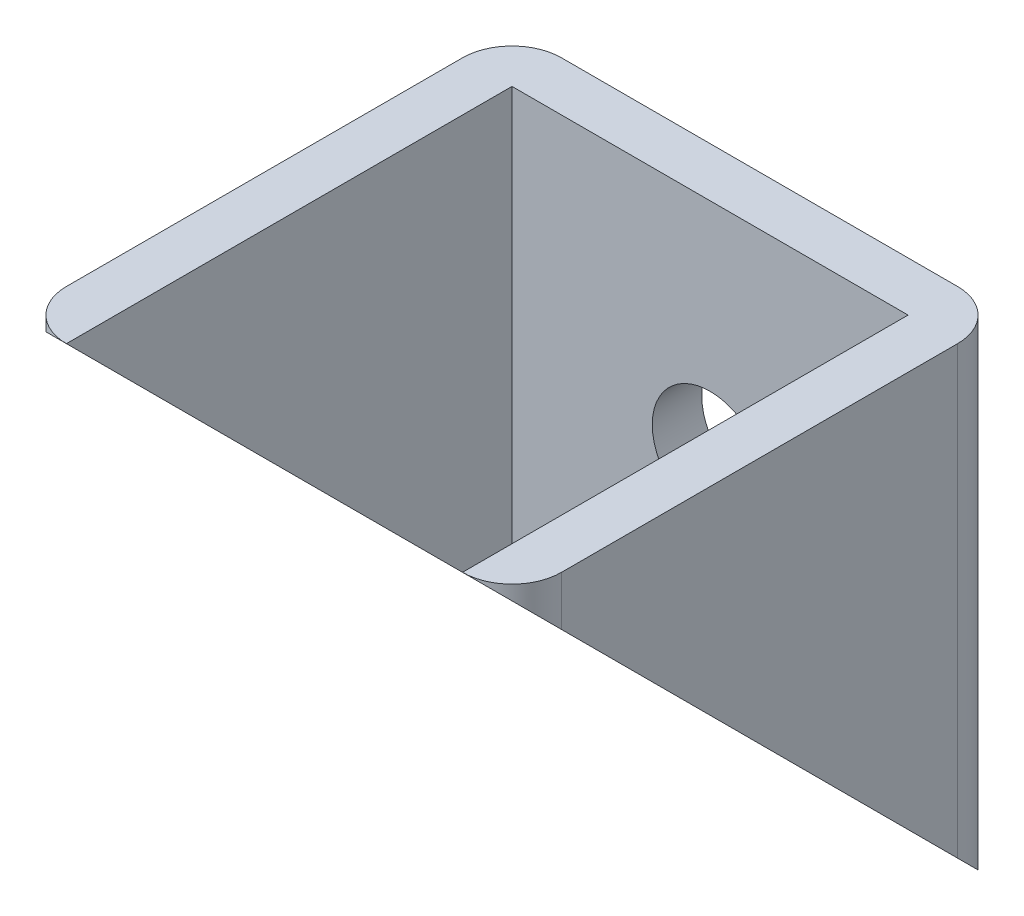
ISO-10303-21;
HEADER;
FILE_DESCRIPTION(('STEP AP214'),'2;1');
FILE_NAME('part.step','',(''),(''),'','','');
FILE_SCHEMA(('AUTOMOTIVE_DESIGN { 1 0 10303 214 1 1 1 1 }'));
ENDSEC;
DATA;
#1=APPLICATION_CONTEXT('core data for automotive mechanical design processes');
#2=APPLICATION_PROTOCOL_DEFINITION('international standard','automotive_design',2000,#1);
#3=PRODUCT_CONTEXT('',#1,'mechanical');
#4=PRODUCT('Part','Part','',(#3));
#5=PRODUCT_RELATED_PRODUCT_CATEGORY('part','',(#4));
#6=PRODUCT_DEFINITION_FORMATION('','',#4);
#7=PRODUCT_DEFINITION_CONTEXT('part definition',#1,'design');
#8=PRODUCT_DEFINITION('design','',#6,#7);
#9=PRODUCT_DEFINITION_SHAPE('','',#8);
#10=(LENGTH_UNIT() NAMED_UNIT(*) SI_UNIT(.MILLI.,.METRE.));
#11=(NAMED_UNIT(*) PLANE_ANGLE_UNIT() SI_UNIT($,.RADIAN.));
#12=(NAMED_UNIT(*) SI_UNIT($,.STERADIAN.) SOLID_ANGLE_UNIT());
#13=UNCERTAINTY_MEASURE_WITH_UNIT(LENGTH_MEASURE(1.E-05),#10,'distance_accuracy_value','');
#14=(GEOMETRIC_REPRESENTATION_CONTEXT(3) GLOBAL_UNCERTAINTY_ASSIGNED_CONTEXT((#13)) GLOBAL_UNIT_ASSIGNED_CONTEXT((#10,
#11,#12)) REPRESENTATION_CONTEXT('',''));
#15=CARTESIAN_POINT('',(0.,0.,0.));
#16=DIRECTION('',(0.,0.,1.));
#17=DIRECTION('',(1.,0.,0.));
#18=AXIS2_PLACEMENT_3D('',#15,#16,#17);
#19=CARTESIAN_POINT('',(12.,387.934536743125,-53.1201374153035));
#20=DIRECTION('',(0.,-1.,0.));
#21=DIRECTION('',(0.,0.,-1.));
#22=AXIS2_PLACEMENT_3D('',#19,#20,#21);
#23=CYLINDRICAL_SURFACE('',#22,3.);
#24=DIRECTION('',(0.,1.,0.));
#25=VECTOR('',#24,1.);
#26=CARTESIAN_POINT('',(15.,387.934536743125,-53.1201374153035));
#27=LINE('',#26,#25);
#28=CARTESIAN_POINT('',(15.,387.934536743125,-53.1201374153035));
#29=VERTEX_POINT('',#28);
#30=CARTESIAN_POINT('',(15.,384.934536743125,-53.1201374153035));
#31=VERTEX_POINT('',#30);
#32=EDGE_CURVE('E173',#29,#31,#27,.F.);
#33=ORIENTED_EDGE('',*,*,#32,.F.);
#34=CARTESIAN_POINT('',(12.,387.934536743125,-53.1201374153035));
#35=DIRECTION('',(0.,-1.,0.));
#36=DIRECTION('',(0.,0.,-1.));
#37=AXIS2_PLACEMENT_3D('',#34,#35,#36);
#38=CIRCLE('',#37,3.);
#39=CARTESIAN_POINT('',(12.,387.934536743125,-50.1201374153035));
#40=VERTEX_POINT('',#39);
#41=EDGE_CURVE('E149',#29,#40,#38,.T.);
#42=ORIENTED_EDGE('',*,*,#41,.T.);
#43=CARTESIAN_POINT('',(12.,384.934536743125,-53.1201374153035));
#44=DIRECTION('',(0.,0.707106781186547,-0.707106781186548));
#45=DIRECTION('',(0.,-0.707106781186548,-0.707106781186547));
#46=AXIS2_PLACEMENT_3D('',#43,#44,#45);
#47=ELLIPSE('',#46,4.24264068711929,3.);
#48=EDGE_CURVE('E141',#40,#31,#47,.T.);
#49=ORIENTED_EDGE('',*,*,#48,.T.);
#50=EDGE_LOOP('',(#33,#42,#49));
#51=FACE_BOUND('',#50,.T.);
#52=ADVANCED_FACE('F17',(#51),#23,.T.);
#53=CARTESIAN_POINT('',(15.,387.934536743125,-77.1201374153035));
#54=DIRECTION('',(1.,0.,0.));
#55=DIRECTION('',(0.,0.,-1.));
#56=AXIS2_PLACEMENT_3D('',#53,#54,#55);
#57=PLANE('',#56);
#58=DIRECTION('',(0.,0.,-1.));
#59=VECTOR('',#58,1.);
#60=CARTESIAN_POINT('',(15.,387.934536743125,-65.1201374153035));
#61=LINE('',#60,#59);
#62=CARTESIAN_POINT('',(15.,387.934536743125,-77.1201374153035));
#63=VERTEX_POINT('',#62);
#64=EDGE_CURVE('E152',#63,#29,#61,.F.);
#65=ORIENTED_EDGE('',*,*,#64,.T.);
#66=ORIENTED_EDGE('',*,*,#32,.T.);
#67=DIRECTION('',(0.,0.707106781186548,0.707106781186547));
#68=VECTOR('',#67,1.);
#69=CARTESIAN_POINT('',(15.,387.934536743125,-50.1201374153035));
#70=LINE('',#69,#68);
#71=CARTESIAN_POINT('',(15.,360.934536743125,-77.1201374153035));
#72=VERTEX_POINT('',#71);
#73=EDGE_CURVE('E139',#31,#72,#70,.F.);
#74=ORIENTED_EDGE('',*,*,#73,.T.);
#75=DIRECTION('',(0.,-1.,0.));
#76=VECTOR('',#75,1.);
#77=CARTESIAN_POINT('',(15.,387.934536743125,-77.1201374153035));
#78=LINE('',#77,#76);
#79=EDGE_CURVE('E143',#63,#72,#78,.T.);
#80=ORIENTED_EDGE('',*,*,#79,.F.);
#81=EDGE_LOOP('',(#65,#66,#74,#80));
#82=FACE_BOUND('',#81,.T.);
#83=ADVANCED_FACE('F212',(#82),#57,.T.);
#84=CARTESIAN_POINT('',(-12.,387.934536743125,-53.1201374153035));
#85=DIRECTION('',(0.,-1.,0.));
#86=DIRECTION('',(0.,0.,-1.));
#87=AXIS2_PLACEMENT_3D('',#84,#85,#86);
#88=CYLINDRICAL_SURFACE('',#87,3.);
#89=CARTESIAN_POINT('',(-12.,387.934536743125,-53.1201374153035));
#90=DIRECTION('',(0.,-1.,0.));
#91=DIRECTION('',(0.,0.,-1.));
#92=AXIS2_PLACEMENT_3D('',#89,#90,#91);
#93=CIRCLE('',#92,3.);
#94=CARTESIAN_POINT('',(-12.,387.934536743125,-50.1201374153035));
#95=VERTEX_POINT('',#94);
#96=CARTESIAN_POINT('',(-15.,387.934536743125,-53.1201374153035));
#97=VERTEX_POINT('',#96);
#98=EDGE_CURVE('E20',#95,#97,#93,.T.);
#99=ORIENTED_EDGE('',*,*,#98,.T.);
#100=DIRECTION('',(0.,1.,0.));
#101=VECTOR('',#100,1.);
#102=CARTESIAN_POINT('',(-15.,387.934536743125,-53.1201374153035));
#103=LINE('',#102,#101);
#104=CARTESIAN_POINT('',(-15.,384.934536743125,-53.1201374153035));
#105=VERTEX_POINT('',#104);
#106=EDGE_CURVE('E166',#105,#97,#103,.T.);
#107=ORIENTED_EDGE('',*,*,#106,.F.);
#108=CARTESIAN_POINT('',(-12.,384.934536743125,-53.1201374153035));
#109=DIRECTION('',(0.,0.707106781186547,-0.707106781186548));
#110=DIRECTION('',(0.,-0.707106781186548,-0.707106781186547));
#111=AXIS2_PLACEMENT_3D('',#108,#109,#110);
#112=ELLIPSE('',#111,4.24264068711929,3.);
#113=EDGE_CURVE('E132',#105,#95,#112,.T.);
#114=ORIENTED_EDGE('',*,*,#113,.T.);
#115=EDGE_LOOP('',(#99,#107,#114));
#116=FACE_BOUND('',#115,.T.);
#117=ADVANCED_FACE('F203',(#116),#88,.T.);
#118=CARTESIAN_POINT('',(-12.,387.934536743125,-77.1201374153035));
#119=DIRECTION('',(1.,0.,0.));
#120=DIRECTION('',(0.,0.,-1.));
#121=AXIS2_PLACEMENT_3D('',#118,#119,#120);
#122=PLANE('',#121);
#123=DIRECTION('',(0.,0.707106781186548,0.707106781186547));
#124=VECTOR('',#123,1.);
#125=CARTESIAN_POINT('',(-12.,387.934536743125,-50.1201374153035));
#126=LINE('',#125,#124);
#127=CARTESIAN_POINT('',(-12.,360.934536743125,-77.1201374153035));
#128=VERTEX_POINT('',#127);
#129=EDGE_CURVE('E130',#95,#128,#126,.F.);
#130=ORIENTED_EDGE('',*,*,#129,.T.);
#131=DIRECTION('',(0.,1.,0.));
#132=VECTOR('',#131,1.);
#133=CARTESIAN_POINT('',(-12.,387.934536743125,-77.1201374153035));
#134=LINE('',#133,#132);
#135=CARTESIAN_POINT('',(-12.,387.934536743125,-77.1201374153035));
#136=VERTEX_POINT('',#135);
#137=EDGE_CURVE('E81',#136,#128,#134,.F.);
#138=ORIENTED_EDGE('',*,*,#137,.F.);
#139=DIRECTION('',(0.,0.,-1.));
#140=VECTOR('',#139,1.);
#141=CARTESIAN_POINT('',(-12.,387.934536743125,-65.1201374153035));
#142=LINE('',#141,#140);
#143=EDGE_CURVE('E75',#136,#95,#142,.F.);
#144=ORIENTED_EDGE('',*,*,#143,.T.);
#145=EDGE_LOOP('',(#130,#138,#144));
#146=FACE_BOUND('',#145,.T.);
#147=ADVANCED_FACE('F201',(#146),#122,.T.);
#148=CARTESIAN_POINT('',(12.,387.934536743125,-53.1201374153035));
#149=DIRECTION('',(-1.,0.,0.));
#150=DIRECTION('',(0.,0.,1.));
#151=AXIS2_PLACEMENT_3D('',#148,#149,#150);
#152=PLANE('',#151);
#153=DIRECTION('',(0.,1.,0.));
#154=VECTOR('',#153,1.);
#155=CARTESIAN_POINT('',(12.,387.934536743125,-77.1201374153035));
#156=LINE('',#155,#154);
#157=CARTESIAN_POINT('',(12.,360.934536743125,-77.1201374153035));
#158=VERTEX_POINT('',#157);
#159=CARTESIAN_POINT('',(12.,387.934536743125,-77.1201374153035));
#160=VERTEX_POINT('',#159);
#161=EDGE_CURVE('E164',#158,#160,#156,.T.);
#162=ORIENTED_EDGE('',*,*,#161,.F.);
#163=DIRECTION('',(0.,0.707106781186548,0.707106781186547));
#164=VECTOR('',#163,1.);
#165=CARTESIAN_POINT('',(12.,387.934536743125,-50.1201374153035));
#166=LINE('',#165,#164);
#167=EDGE_CURVE('E124',#158,#40,#166,.T.);
#168=ORIENTED_EDGE('',*,*,#167,.T.);
#169=DIRECTION('',(0.,0.,-1.));
#170=VECTOR('',#169,1.);
#171=CARTESIAN_POINT('',(12.,387.934536743125,-65.1201374153035));
#172=LINE('',#171,#170);
#173=EDGE_CURVE('E146',#40,#160,#172,.T.);
#174=ORIENTED_EDGE('',*,*,#173,.T.);
#175=EDGE_LOOP('',(#162,#168,#174));
#176=FACE_BOUND('',#175,.T.);
#177=ADVANCED_FACE('F195',(#176),#152,.T.);
#178=CARTESIAN_POINT('',(-15.,387.934536743125,-53.1201374153035));
#179=DIRECTION('',(-1.,0.,0.));
#180=DIRECTION('',(0.,0.,1.));
#181=AXIS2_PLACEMENT_3D('',#178,#179,#180);
#182=PLANE('',#181);
#183=DIRECTION('',(0.,0.,-1.));
#184=VECTOR('',#183,1.);
#185=CARTESIAN_POINT('',(-15.,387.934536743125,-65.1201374153035));
#186=LINE('',#185,#184);
#187=CARTESIAN_POINT('',(-15.,387.934536743125,-77.1201374153035));
#188=VERTEX_POINT('',#187);
#189=EDGE_CURVE('E93',#97,#188,#186,.T.);
#190=ORIENTED_EDGE('',*,*,#189,.T.);
#191=DIRECTION('',(0.,-1.,0.));
#192=VECTOR('',#191,1.);
#193=CARTESIAN_POINT('',(-15.,387.934536743125,-77.1201374153035));
#194=LINE('',#193,#192);
#195=CARTESIAN_POINT('',(-15.,360.934536743125,-77.1201374153035));
#196=VERTEX_POINT('',#195);
#197=EDGE_CURVE('E116',#196,#188,#194,.F.);
#198=ORIENTED_EDGE('',*,*,#197,.F.);
#199=DIRECTION('',(0.,0.707106781186548,0.707106781186547));
#200=VECTOR('',#199,1.);
#201=CARTESIAN_POINT('',(-15.,387.934536743125,-50.1201374153035));
#202=LINE('',#201,#200);
#203=EDGE_CURVE('E135',#196,#105,#202,.T.);
#204=ORIENTED_EDGE('',*,*,#203,.T.);
#205=ORIENTED_EDGE('',*,*,#106,.T.);
#206=EDGE_LOOP('',(#190,#198,#204,#205));
#207=FACE_BOUND('',#206,.T.);
#208=ADVANCED_FACE('F210',(#207),#182,.T.);
#209=CARTESIAN_POINT('',(12.,387.934536743125,-77.1201374153035));
#210=DIRECTION('',(0.,0.,1.));
#211=DIRECTION('',(1.,0.,0.));
#212=AXIS2_PLACEMENT_3D('',#209,#210,#211);
#213=PLANE('',#212);
#214=CARTESIAN_POINT('',(0.,374.434536743125,-77.1201374153035));
#215=DIRECTION('',(0.,0.,-1.));
#216=DIRECTION('',(-1.,0.,0.));
#217=AXIS2_PLACEMENT_3D('',#214,#215,#216);
#218=CIRCLE('',#217,3.50000000000001);
#219=CARTESIAN_POINT('',(-3.50000000000001,374.434536743125,-77.1201374153035));
#220=VERTEX_POINT('',#219);
#221=EDGE_CURVE('E111',#220,#220,#218,.T.);
#222=ORIENTED_EDGE('',*,*,#221,.T.);
#223=EDGE_LOOP('',(#222));
#224=FACE_BOUND('',#223,.T.);
#225=DIRECTION('',(1.,0.,0.));
#226=VECTOR('',#225,1.);
#227=CARTESIAN_POINT('',(0.,387.934536743125,-77.1201374153035));
#228=LINE('',#227,#226);
#229=EDGE_CURVE('E157',#160,#136,#228,.F.);
#230=ORIENTED_EDGE('',*,*,#229,.T.);
#231=ORIENTED_EDGE('',*,*,#137,.T.);
#232=DIRECTION('',(1.,0.,0.));
#233=VECTOR('',#232,1.);
#234=CARTESIAN_POINT('',(-15.,360.934536743125,-77.1201374153035));
#235=LINE('',#234,#233);
#236=EDGE_CURVE('E127',#128,#158,#235,.T.);
#237=ORIENTED_EDGE('',*,*,#236,.T.);
#238=ORIENTED_EDGE('',*,*,#161,.T.);
#239=EDGE_LOOP('',(#230,#231,#237,#238));
#240=FACE_BOUND('',#239,.T.);
#241=ADVANCED_FACE('F199',(#224,#240),#213,.T.);
#242=CARTESIAN_POINT('',(0.,387.934536743125,-65.1201374153035));
#243=DIRECTION('',(0.,-1.,0.));
#244=DIRECTION('',(0.,0.,-1.));
#245=AXIS2_PLACEMENT_3D('',#242,#243,#244);
#246=PLANE('',#245);
#247=ORIENTED_EDGE('',*,*,#41,.F.);
#248=ORIENTED_EDGE('',*,*,#64,.F.);
#249=CARTESIAN_POINT('',(12.,387.934536743125,-77.1201374153035));
#250=DIRECTION('',(0.,-1.,0.));
#251=DIRECTION('',(0.,0.,-1.));
#252=AXIS2_PLACEMENT_3D('',#249,#250,#251);
#253=CIRCLE('',#252,3.00000000000001);
#254=CARTESIAN_POINT('',(12.,387.934536743125,-80.1201374153035));
#255=VERTEX_POINT('',#254);
#256=EDGE_CURVE('E105',#255,#63,#253,.T.);
#257=ORIENTED_EDGE('',*,*,#256,.F.);
#258=DIRECTION('',(-1.,0.,0.));
#259=VECTOR('',#258,1.);
#260=CARTESIAN_POINT('',(-12.,387.934536743125,-80.1201374153035));
#261=LINE('',#260,#259);
#262=CARTESIAN_POINT('',(-12.,387.934536743125,-80.1201374153035));
#263=VERTEX_POINT('',#262);
#264=EDGE_CURVE('E98',#263,#255,#261,.F.);
#265=ORIENTED_EDGE('',*,*,#264,.F.);
#266=CARTESIAN_POINT('',(-12.,387.934536743125,-77.1201374153035));
#267=DIRECTION('',(0.,-1.,0.));
#268=DIRECTION('',(0.,0.,-1.));
#269=AXIS2_PLACEMENT_3D('',#266,#267,#268);
#270=CIRCLE('',#269,3.);
#271=EDGE_CURVE('E102',#188,#263,#270,.T.);
#272=ORIENTED_EDGE('',*,*,#271,.F.);
#273=ORIENTED_EDGE('',*,*,#189,.F.);
#274=ORIENTED_EDGE('',*,*,#98,.F.);
#275=ORIENTED_EDGE('',*,*,#143,.F.);
#276=ORIENTED_EDGE('',*,*,#229,.F.);
#277=ORIENTED_EDGE('',*,*,#173,.F.);
#278=EDGE_LOOP('',(#247,#248,#257,#265,#272,#273,#274,#275,#276,#277));
#279=FACE_BOUND('',#278,.T.);
#280=ADVANCED_FACE('F101',(#279),#246,.F.);
#281=CARTESIAN_POINT('',(12.,387.934536743125,-77.1201374153035));
#282=DIRECTION('',(0.,-1.,0.));
#283=DIRECTION('',(0.,0.,-1.));
#284=AXIS2_PLACEMENT_3D('',#281,#282,#283);
#285=CYLINDRICAL_SURFACE('',#284,3.00000000000001);
#286=ORIENTED_EDGE('',*,*,#256,.T.);
#287=ORIENTED_EDGE('',*,*,#79,.T.);
#288=CARTESIAN_POINT('',(12.,360.934536743125,-77.1201374153035));
#289=DIRECTION('',(0.,0.707106781186547,-0.707106781186548));
#290=DIRECTION('',(0.,-0.707106781186548,-0.707106781186547));
#291=AXIS2_PLACEMENT_3D('',#288,#289,#290);
#292=ELLIPSE('',#291,4.2426406871193,3.00000000000001);
#293=CARTESIAN_POINT('',(12.,357.934536743125,-80.1201374153035));
#294=VERTEX_POINT('',#293);
#295=EDGE_CURVE('E138',#72,#294,#292,.T.);
#296=ORIENTED_EDGE('',*,*,#295,.T.);
#297=DIRECTION('',(0.,1.,0.));
#298=VECTOR('',#297,1.);
#299=CARTESIAN_POINT('',(12.,387.934536743125,-80.1201374153035));
#300=LINE('',#299,#298);
#301=EDGE_CURVE('E110',#255,#294,#300,.F.);
#302=ORIENTED_EDGE('',*,*,#301,.F.);
#303=EDGE_LOOP('',(#286,#287,#296,#302));
#304=FACE_BOUND('',#303,.T.);
#305=ADVANCED_FACE('F229',(#304),#285,.T.);
#306=CARTESIAN_POINT('',(-15.,387.934536743125,-50.1201374153035));
#307=DIRECTION('',(0.,0.707106781186547,-0.707106781186548));
#308=DIRECTION('',(0.,0.707106781186548,0.707106781186547));
#309=AXIS2_PLACEMENT_3D('',#306,#307,#308);
#310=PLANE('',#309);
#311=ORIENTED_EDGE('',*,*,#236,.F.);
#312=ORIENTED_EDGE('',*,*,#129,.F.);
#313=ORIENTED_EDGE('',*,*,#113,.F.);
#314=ORIENTED_EDGE('',*,*,#203,.F.);
#315=CARTESIAN_POINT('',(-12.,360.934536743125,-77.1201374153035));
#316=DIRECTION('',(0.,0.707106781186547,-0.707106781186548));
#317=DIRECTION('',(0.,-0.707106781186548,-0.707106781186547));
#318=AXIS2_PLACEMENT_3D('',#315,#316,#317);
#319=ELLIPSE('',#318,4.24264068711929,3.);
#320=CARTESIAN_POINT('',(-12.,357.934536743125,-80.1201374153035));
#321=VERTEX_POINT('',#320);
#322=EDGE_CURVE('E35',#321,#196,#319,.T.);
#323=ORIENTED_EDGE('',*,*,#322,.F.);
#324=DIRECTION('',(-1.,0.,0.));
#325=VECTOR('',#324,1.);
#326=CARTESIAN_POINT('',(-12.,357.934536743125,-80.1201374153035));
#327=LINE('',#326,#325);
#328=EDGE_CURVE('E119',#294,#321,#327,.T.);
#329=ORIENTED_EDGE('',*,*,#328,.F.);
#330=ORIENTED_EDGE('',*,*,#295,.F.);
#331=ORIENTED_EDGE('',*,*,#73,.F.);
#332=ORIENTED_EDGE('',*,*,#48,.F.);
#333=ORIENTED_EDGE('',*,*,#167,.F.);
#334=EDGE_LOOP('',(#311,#312,#313,#314,#323,#329,#330,#331,#332,#333));
#335=FACE_BOUND('',#334,.T.);
#336=ADVANCED_FACE('F192',(#335),#310,.F.);
#337=CARTESIAN_POINT('',(-12.,387.934536743125,-77.1201374153035));
#338=DIRECTION('',(0.,-1.,0.));
#339=DIRECTION('',(0.,0.,-1.));
#340=AXIS2_PLACEMENT_3D('',#337,#338,#339);
#341=CYLINDRICAL_SURFACE('',#340,3.);
#342=ORIENTED_EDGE('',*,*,#271,.T.);
#343=DIRECTION('',(0.,1.,0.));
#344=VECTOR('',#343,1.);
#345=CARTESIAN_POINT('',(-12.,387.934536743125,-80.1201374153035));
#346=LINE('',#345,#344);
#347=EDGE_CURVE('E26',#321,#263,#346,.T.);
#348=ORIENTED_EDGE('',*,*,#347,.F.);
#349=ORIENTED_EDGE('',*,*,#322,.T.);
#350=ORIENTED_EDGE('',*,*,#197,.T.);
#351=EDGE_LOOP('',(#342,#348,#349,#350));
#352=FACE_BOUND('',#351,.T.);
#353=ADVANCED_FACE('F114',(#352),#341,.T.);
#354=CARTESIAN_POINT('',(0.,374.434536743125,-77.1201374153035));
#355=DIRECTION('',(0.,0.,-1.));
#356=DIRECTION('',(-1.,0.,0.));
#357=AXIS2_PLACEMENT_3D('',#354,#355,#356);
#358=CYLINDRICAL_SURFACE('',#357,3.50000000000001);
#359=ORIENTED_EDGE('',*,*,#221,.F.);
#360=EDGE_LOOP('',(#359));
#361=FACE_BOUND('',#360,.T.);
#362=CARTESIAN_POINT('',(0.,374.434536743125,-80.1201374153035));
#363=DIRECTION('',(0.,0.,-1.));
#364=DIRECTION('',(-1.,0.,0.));
#365=AXIS2_PLACEMENT_3D('',#362,#363,#364);
#366=CIRCLE('',#365,3.50000000000001);
#367=CARTESIAN_POINT('',(-3.50000000000001,374.434536743125,-80.1201374153035));
#368=VERTEX_POINT('',#367);
#369=EDGE_CURVE('E11',#368,#368,#366,.F.);
#370=ORIENTED_EDGE('',*,*,#369,.F.);
#371=EDGE_LOOP('',(#370));
#372=FACE_BOUND('',#371,.T.);
#373=ADVANCED_FACE('F216',(#361,#372),#358,.F.);
#374=CARTESIAN_POINT('',(-12.,387.934536743125,-80.1201374153035));
#375=DIRECTION('',(0.,0.,-1.));
#376=DIRECTION('',(-1.,0.,0.));
#377=AXIS2_PLACEMENT_3D('',#374,#375,#376);
#378=PLANE('',#377);
#379=ORIENTED_EDGE('',*,*,#369,.T.);
#380=EDGE_LOOP('',(#379));
#381=FACE_BOUND('',#380,.T.);
#382=ORIENTED_EDGE('',*,*,#328,.T.);
#383=ORIENTED_EDGE('',*,*,#347,.T.);
#384=ORIENTED_EDGE('',*,*,#264,.T.);
#385=ORIENTED_EDGE('',*,*,#301,.T.);
#386=EDGE_LOOP('',(#382,#383,#384,#385));
#387=FACE_BOUND('',#386,.T.);
#388=ADVANCED_FACE('F118',(#381,#387),#378,.T.);
#389=CLOSED_SHELL('',(#52,#83,#117,#147,#177,#208,#241,#280,#305,#336,#353,#373,#388));
#390=MANIFOLD_SOLID_BREP('B1',#389);
#391=ADVANCED_BREP_SHAPE_REPRESENTATION('',(#18,#390),#14);
#392=SHAPE_DEFINITION_REPRESENTATION(#9,#391);
ENDSEC;
END-ISO-10303-21;
